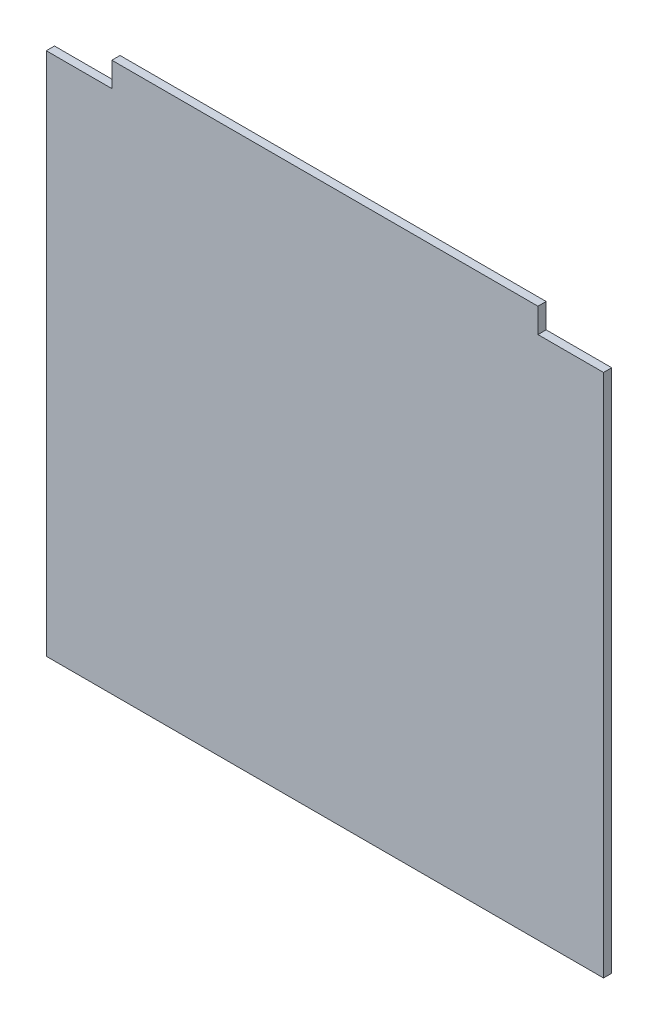
ISO-10303-21;
HEADER;
FILE_DESCRIPTION(('STEP AP214'),'2;1');
FILE_NAME('part.step','',(''),(''),'','','');
FILE_SCHEMA(('AUTOMOTIVE_DESIGN { 1 0 10303 214 1 1 1 1 }'));
ENDSEC;
DATA;
#1=APPLICATION_CONTEXT('core data for automotive mechanical design processes');
#2=APPLICATION_PROTOCOL_DEFINITION('international standard','automotive_design',2000,#1);
#3=PRODUCT_CONTEXT('',#1,'mechanical');
#4=PRODUCT('Part','Part','',(#3));
#5=PRODUCT_RELATED_PRODUCT_CATEGORY('part','',(#4));
#6=PRODUCT_DEFINITION_FORMATION('','',#4);
#7=PRODUCT_DEFINITION_CONTEXT('part definition',#1,'design');
#8=PRODUCT_DEFINITION('design','',#6,#7);
#9=PRODUCT_DEFINITION_SHAPE('','',#8);
#10=(LENGTH_UNIT() NAMED_UNIT(*) SI_UNIT(.MILLI.,.METRE.));
#11=(NAMED_UNIT(*) PLANE_ANGLE_UNIT() SI_UNIT($,.RADIAN.));
#12=(NAMED_UNIT(*) SI_UNIT($,.STERADIAN.) SOLID_ANGLE_UNIT());
#13=UNCERTAINTY_MEASURE_WITH_UNIT(LENGTH_MEASURE(1.E-05),#10,'distance_accuracy_value','');
#14=(GEOMETRIC_REPRESENTATION_CONTEXT(3) GLOBAL_UNCERTAINTY_ASSIGNED_CONTEXT((#13)) GLOBAL_UNIT_ASSIGNED_CONTEXT((#10,
#11,#12)) REPRESENTATION_CONTEXT('',''));
#15=CARTESIAN_POINT('',(0.,0.,0.));
#16=DIRECTION('',(0.,0.,1.));
#17=DIRECTION('',(1.,0.,0.));
#18=AXIS2_PLACEMENT_3D('',#15,#16,#17);
#19=CARTESIAN_POINT('',(-340.,335.,10.));
#20=DIRECTION('',(1.,0.,0.));
#21=DIRECTION('',(0.,1.,0.));
#22=AXIS2_PLACEMENT_3D('',#19,#20,#21);
#23=PLANE('',#22);
#24=DIRECTION('',(0.,-1.,0.));
#25=VECTOR('',#24,1.);
#26=CARTESIAN_POINT('',(-340.,335.,10.));
#27=LINE('',#26,#25);
#28=CARTESIAN_POINT('',(-340.,305.,10.));
#29=VERTEX_POINT('',#28);
#30=CARTESIAN_POINT('',(-340.,-335.,10.));
#31=VERTEX_POINT('',#30);
#32=EDGE_CURVE('E117',#29,#31,#27,.T.);
#33=ORIENTED_EDGE('',*,*,#32,.F.);
#34=DIRECTION('',(0.,0.,1.));
#35=VECTOR('',#34,1.);
#36=CARTESIAN_POINT('',(-340.,305.,0.));
#37=LINE('',#36,#35);
#38=CARTESIAN_POINT('',(-340.,305.,0.));
#39=VERTEX_POINT('',#38);
#40=EDGE_CURVE('E158',#39,#29,#37,.T.);
#41=ORIENTED_EDGE('',*,*,#40,.F.);
#42=DIRECTION('',(0.,-1.,0.));
#43=VECTOR('',#42,1.);
#44=CARTESIAN_POINT('',(-340.,335.,0.));
#45=LINE('',#44,#43);
#46=CARTESIAN_POINT('',(-340.,-335.,0.));
#47=VERTEX_POINT('',#46);
#48=EDGE_CURVE('E140',#39,#47,#45,.T.);
#49=ORIENTED_EDGE('',*,*,#48,.T.);
#50=DIRECTION('',(0.,0.,-1.));
#51=VECTOR('',#50,1.);
#52=CARTESIAN_POINT('',(-340.,-335.,10.));
#53=LINE('',#52,#51);
#54=EDGE_CURVE('E11',#31,#47,#53,.T.);
#55=ORIENTED_EDGE('',*,*,#54,.F.);
#56=EDGE_LOOP('',(#33,#41,#49,#55));
#57=FACE_BOUND('',#56,.T.);
#58=ADVANCED_FACE('F33',(#57),#23,.F.);
#59=CARTESIAN_POINT('',(-340.,-335.,10.));
#60=DIRECTION('',(0.,1.,0.));
#61=DIRECTION('',(0.,0.,1.));
#62=AXIS2_PLACEMENT_3D('',#59,#60,#61);
#63=PLANE('',#62);
#64=DIRECTION('',(1.,0.,0.));
#65=VECTOR('',#64,1.);
#66=CARTESIAN_POINT('',(-340.,-335.,0.));
#67=LINE('',#66,#65);
#68=CARTESIAN_POINT('',(340.,-335.,0.));
#69=VERTEX_POINT('',#68);
#70=EDGE_CURVE('E123',#47,#69,#67,.T.);
#71=ORIENTED_EDGE('',*,*,#70,.T.);
#72=DIRECTION('',(0.,0.,-1.));
#73=VECTOR('',#72,1.);
#74=CARTESIAN_POINT('',(340.,-335.,10.));
#75=LINE('',#74,#73);
#76=CARTESIAN_POINT('',(340.,-335.,10.));
#77=VERTEX_POINT('',#76);
#78=EDGE_CURVE('E40',#77,#69,#75,.T.);
#79=ORIENTED_EDGE('',*,*,#78,.F.);
#80=DIRECTION('',(1.,0.,0.));
#81=VECTOR('',#80,1.);
#82=CARTESIAN_POINT('',(-340.,-335.,10.));
#83=LINE('',#82,#81);
#84=EDGE_CURVE('E120',#31,#77,#83,.T.);
#85=ORIENTED_EDGE('',*,*,#84,.F.);
#86=ORIENTED_EDGE('',*,*,#54,.T.);
#87=EDGE_LOOP('',(#71,#79,#85,#86));
#88=FACE_BOUND('',#87,.T.);
#89=ADVANCED_FACE('F144',(#88),#63,.F.);
#90=CARTESIAN_POINT('',(340.,335.,10.));
#91=DIRECTION('',(-1.,0.,0.));
#92=DIRECTION('',(0.,-1.,0.));
#93=AXIS2_PLACEMENT_3D('',#90,#91,#92);
#94=PLANE('',#93);
#95=DIRECTION('',(0.,1.,0.));
#96=VECTOR('',#95,1.);
#97=CARTESIAN_POINT('',(340.,335.,0.));
#98=LINE('',#97,#96);
#99=CARTESIAN_POINT('',(340.,305.,0.));
#100=VERTEX_POINT('',#99);
#101=EDGE_CURVE('E118',#69,#100,#98,.T.);
#102=ORIENTED_EDGE('',*,*,#101,.T.);
#103=DIRECTION('',(0.,0.,1.));
#104=VECTOR('',#103,1.);
#105=CARTESIAN_POINT('',(340.,305.,0.));
#106=LINE('',#105,#104);
#107=CARTESIAN_POINT('',(340.,305.,10.));
#108=VERTEX_POINT('',#107);
#109=EDGE_CURVE('E150',#100,#108,#106,.T.);
#110=ORIENTED_EDGE('',*,*,#109,.T.);
#111=DIRECTION('',(0.,1.,0.));
#112=VECTOR('',#111,1.);
#113=CARTESIAN_POINT('',(340.,335.,10.));
#114=LINE('',#113,#112);
#115=EDGE_CURVE('E131',#77,#108,#114,.T.);
#116=ORIENTED_EDGE('',*,*,#115,.F.);
#117=ORIENTED_EDGE('',*,*,#78,.T.);
#118=EDGE_LOOP('',(#102,#110,#116,#117));
#119=FACE_BOUND('',#118,.T.);
#120=ADVANCED_FACE('F149',(#119),#94,.F.);
#121=CARTESIAN_POINT('',(-340.,335.,10.));
#122=DIRECTION('',(0.,-1.,0.));
#123=DIRECTION('',(1.,0.,0.));
#124=AXIS2_PLACEMENT_3D('',#121,#122,#123);
#125=PLANE('',#124);
#126=DIRECTION('',(-1.,0.,0.));
#127=VECTOR('',#126,1.);
#128=CARTESIAN_POINT('',(-340.,335.,10.));
#129=LINE('',#128,#127);
#130=CARTESIAN_POINT('',(260.,335.,10.));
#131=VERTEX_POINT('',#130);
#132=CARTESIAN_POINT('',(-260.,335.,10.));
#133=VERTEX_POINT('',#132);
#134=EDGE_CURVE('E113',#131,#133,#129,.T.);
#135=ORIENTED_EDGE('',*,*,#134,.F.);
#136=DIRECTION('',(0.,0.,1.));
#137=VECTOR('',#136,1.);
#138=CARTESIAN_POINT('',(260.,335.,0.));
#139=LINE('',#138,#137);
#140=CARTESIAN_POINT('',(260.,335.,0.));
#141=VERTEX_POINT('',#140);
#142=EDGE_CURVE('E101',#141,#131,#139,.T.);
#143=ORIENTED_EDGE('',*,*,#142,.F.);
#144=DIRECTION('',(-1.,0.,0.));
#145=VECTOR('',#144,1.);
#146=CARTESIAN_POINT('',(-340.,335.,0.));
#147=LINE('',#146,#145);
#148=CARTESIAN_POINT('',(-260.,335.,0.));
#149=VERTEX_POINT('',#148);
#150=EDGE_CURVE('E112',#141,#149,#147,.T.);
#151=ORIENTED_EDGE('',*,*,#150,.T.);
#152=DIRECTION('',(0.,0.,1.));
#153=VECTOR('',#152,1.);
#154=CARTESIAN_POINT('',(-260.,335.,0.));
#155=LINE('',#154,#153);
#156=EDGE_CURVE('E141',#149,#133,#155,.T.);
#157=ORIENTED_EDGE('',*,*,#156,.T.);
#158=EDGE_LOOP('',(#135,#143,#151,#157));
#159=FACE_BOUND('',#158,.T.);
#160=ADVANCED_FACE('F110',(#159),#125,.F.);
#161=CARTESIAN_POINT('',(0.,0.,10.));
#162=DIRECTION('',(0.,0.,1.));
#163=DIRECTION('',(1.,0.,0.));
#164=AXIS2_PLACEMENT_3D('',#161,#162,#163);
#165=PLANE('',#164);
#166=DIRECTION('',(1.,0.,0.));
#167=VECTOR('',#166,1.);
#168=CARTESIAN_POINT('',(340.,305.,10.));
#169=LINE('',#168,#167);
#170=CARTESIAN_POINT('',(260.,305.,10.));
#171=VERTEX_POINT('',#170);
#172=EDGE_CURVE('E106',#171,#108,#169,.T.);
#173=ORIENTED_EDGE('',*,*,#172,.F.);
#174=DIRECTION('',(0.,-1.,0.));
#175=VECTOR('',#174,1.);
#176=CARTESIAN_POINT('',(260.,335.,10.));
#177=LINE('',#176,#175);
#178=EDGE_CURVE('E172',#131,#171,#177,.T.);
#179=ORIENTED_EDGE('',*,*,#178,.F.);
#180=ORIENTED_EDGE('',*,*,#134,.T.);
#181=DIRECTION('',(0.,1.,0.));
#182=VECTOR('',#181,1.);
#183=CARTESIAN_POINT('',(-260.,335.,10.));
#184=LINE('',#183,#182);
#185=CARTESIAN_POINT('',(-260.,305.,10.));
#186=VERTEX_POINT('',#185);
#187=EDGE_CURVE('E163',#186,#133,#184,.T.);
#188=ORIENTED_EDGE('',*,*,#187,.F.);
#189=DIRECTION('',(1.,0.,0.));
#190=VECTOR('',#189,1.);
#191=CARTESIAN_POINT('',(-340.,305.,10.));
#192=LINE('',#191,#190);
#193=EDGE_CURVE('E151',#29,#186,#192,.T.);
#194=ORIENTED_EDGE('',*,*,#193,.F.);
#195=ORIENTED_EDGE('',*,*,#32,.T.);
#196=ORIENTED_EDGE('',*,*,#84,.T.);
#197=ORIENTED_EDGE('',*,*,#115,.T.);
#198=EDGE_LOOP('',(#173,#179,#180,#188,#194,#195,#196,#197));
#199=FACE_BOUND('',#198,.T.);
#200=ADVANCED_FACE('F154',(#199),#165,.T.);
#201=CARTESIAN_POINT('',(0.,0.,0.));
#202=DIRECTION('',(0.,0.,1.));
#203=DIRECTION('',(1.,0.,0.));
#204=AXIS2_PLACEMENT_3D('',#201,#202,#203);
#205=PLANE('',#204);
#206=DIRECTION('',(0.,-1.,0.));
#207=VECTOR('',#206,1.);
#208=CARTESIAN_POINT('',(260.,335.,0.));
#209=LINE('',#208,#207);
#210=CARTESIAN_POINT('',(260.,305.,0.));
#211=VERTEX_POINT('',#210);
#212=EDGE_CURVE('E97',#141,#211,#209,.T.);
#213=ORIENTED_EDGE('',*,*,#212,.T.);
#214=DIRECTION('',(1.,0.,0.));
#215=VECTOR('',#214,1.);
#216=CARTESIAN_POINT('',(340.,305.,0.));
#217=LINE('',#216,#215);
#218=EDGE_CURVE('E47',#211,#100,#217,.T.);
#219=ORIENTED_EDGE('',*,*,#218,.T.);
#220=ORIENTED_EDGE('',*,*,#101,.F.);
#221=ORIENTED_EDGE('',*,*,#70,.F.);
#222=ORIENTED_EDGE('',*,*,#48,.F.);
#223=DIRECTION('',(1.,0.,0.));
#224=VECTOR('',#223,1.);
#225=CARTESIAN_POINT('',(-340.,305.,0.));
#226=LINE('',#225,#224);
#227=CARTESIAN_POINT('',(-260.,305.,0.));
#228=VERTEX_POINT('',#227);
#229=EDGE_CURVE('E165',#39,#228,#226,.T.);
#230=ORIENTED_EDGE('',*,*,#229,.T.);
#231=DIRECTION('',(0.,1.,0.));
#232=VECTOR('',#231,1.);
#233=CARTESIAN_POINT('',(-260.,335.,0.));
#234=LINE('',#233,#232);
#235=EDGE_CURVE('E55',#228,#149,#234,.T.);
#236=ORIENTED_EDGE('',*,*,#235,.T.);
#237=ORIENTED_EDGE('',*,*,#150,.F.);
#238=EDGE_LOOP('',(#213,#219,#220,#221,#222,#230,#236,#237));
#239=FACE_BOUND('',#238,.T.);
#240=ADVANCED_FACE('F115',(#239),#205,.F.);
#241=CARTESIAN_POINT('',(-260.,335.,0.));
#242=DIRECTION('',(1.,0.,0.));
#243=DIRECTION('',(0.,0.,-1.));
#244=AXIS2_PLACEMENT_3D('',#241,#242,#243);
#245=PLANE('',#244);
#246=ORIENTED_EDGE('',*,*,#187,.T.);
#247=ORIENTED_EDGE('',*,*,#156,.F.);
#248=ORIENTED_EDGE('',*,*,#235,.F.);
#249=DIRECTION('',(0.,0.,1.));
#250=VECTOR('',#249,1.);
#251=CARTESIAN_POINT('',(-260.,305.,0.));
#252=LINE('',#251,#250);
#253=EDGE_CURVE('E160',#228,#186,#252,.T.);
#254=ORIENTED_EDGE('',*,*,#253,.T.);
#255=EDGE_LOOP('',(#246,#247,#248,#254));
#256=FACE_BOUND('',#255,.T.);
#257=ADVANCED_FACE('F183',(#256),#245,.F.);
#258=CARTESIAN_POINT('',(-340.,305.,0.));
#259=DIRECTION('',(0.,-1.,0.));
#260=DIRECTION('',(0.,0.,-1.));
#261=AXIS2_PLACEMENT_3D('',#258,#259,#260);
#262=PLANE('',#261);
#263=ORIENTED_EDGE('',*,*,#193,.T.);
#264=ORIENTED_EDGE('',*,*,#253,.F.);
#265=ORIENTED_EDGE('',*,*,#229,.F.);
#266=ORIENTED_EDGE('',*,*,#40,.T.);
#267=EDGE_LOOP('',(#263,#264,#265,#266));
#268=FACE_BOUND('',#267,.T.);
#269=ADVANCED_FACE('F176',(#268),#262,.F.);
#270=CARTESIAN_POINT('',(340.,305.,0.));
#271=DIRECTION('',(0.,-1.,0.));
#272=DIRECTION('',(0.,0.,-1.));
#273=AXIS2_PLACEMENT_3D('',#270,#271,#272);
#274=PLANE('',#273);
#275=ORIENTED_EDGE('',*,*,#172,.T.);
#276=ORIENTED_EDGE('',*,*,#109,.F.);
#277=ORIENTED_EDGE('',*,*,#218,.F.);
#278=DIRECTION('',(0.,0.,1.));
#279=VECTOR('',#278,1.);
#280=CARTESIAN_POINT('',(260.,305.,0.));
#281=LINE('',#280,#279);
#282=EDGE_CURVE('E103',#211,#171,#281,.T.);
#283=ORIENTED_EDGE('',*,*,#282,.T.);
#284=EDGE_LOOP('',(#275,#276,#277,#283));
#285=FACE_BOUND('',#284,.T.);
#286=ADVANCED_FACE('F174',(#285),#274,.F.);
#287=CARTESIAN_POINT('',(260.,335.,0.));
#288=DIRECTION('',(-1.,0.,0.));
#289=DIRECTION('',(0.,-1.,0.));
#290=AXIS2_PLACEMENT_3D('',#287,#288,#289);
#291=PLANE('',#290);
#292=ORIENTED_EDGE('',*,*,#178,.T.);
#293=ORIENTED_EDGE('',*,*,#282,.F.);
#294=ORIENTED_EDGE('',*,*,#212,.F.);
#295=ORIENTED_EDGE('',*,*,#142,.T.);
#296=EDGE_LOOP('',(#292,#293,#294,#295));
#297=FACE_BOUND('',#296,.T.);
#298=ADVANCED_FACE('F100',(#297),#291,.F.);
#299=CLOSED_SHELL('',(#58,#89,#120,#160,#200,#240,#257,#269,#286,#298));
#300=MANIFOLD_SOLID_BREP('B2',#299);
#301=ADVANCED_BREP_SHAPE_REPRESENTATION('',(#18,#300),#14);
#302=SHAPE_DEFINITION_REPRESENTATION(#9,#301);
ENDSEC;
END-ISO-10303-21;
